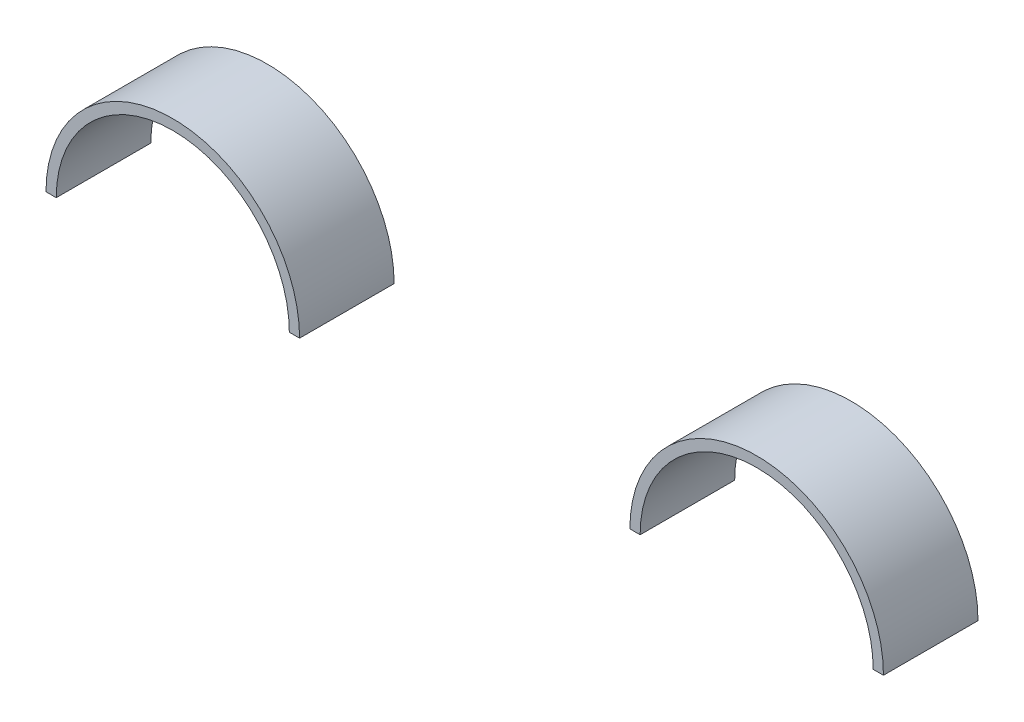
ISO-10303-21;
HEADER;
FILE_DESCRIPTION(('STEP AP214'),'2;1');
FILE_NAME('part.step','',(''),(''),'','','');
FILE_SCHEMA(('AUTOMOTIVE_DESIGN { 1 0 10303 214 1 1 1 1 }'));
ENDSEC;
DATA;
#1=APPLICATION_CONTEXT('core data for automotive mechanical design processes');
#2=APPLICATION_PROTOCOL_DEFINITION('international standard','automotive_design',2000,#1);
#3=PRODUCT_CONTEXT('',#1,'mechanical');
#4=PRODUCT('Part','Part','',(#3));
#5=PRODUCT_RELATED_PRODUCT_CATEGORY('part','',(#4));
#6=PRODUCT_DEFINITION_FORMATION('','',#4);
#7=PRODUCT_DEFINITION_CONTEXT('part definition',#1,'design');
#8=PRODUCT_DEFINITION('design','',#6,#7);
#9=PRODUCT_DEFINITION_SHAPE('','',#8);
#10=(LENGTH_UNIT() NAMED_UNIT(*) SI_UNIT(.MILLI.,.METRE.));
#11=(NAMED_UNIT(*) PLANE_ANGLE_UNIT() SI_UNIT($,.RADIAN.));
#12=(NAMED_UNIT(*) SI_UNIT($,.STERADIAN.) SOLID_ANGLE_UNIT());
#13=UNCERTAINTY_MEASURE_WITH_UNIT(LENGTH_MEASURE(1.E-05),#10,'distance_accuracy_value','');
#14=(GEOMETRIC_REPRESENTATION_CONTEXT(3) GLOBAL_UNCERTAINTY_ASSIGNED_CONTEXT((#13)) GLOBAL_UNIT_ASSIGNED_CONTEXT((#10,
#11,#12)) REPRESENTATION_CONTEXT('',''));
#15=CARTESIAN_POINT('',(0.,0.,0.));
#16=DIRECTION('',(0.,0.,1.));
#17=DIRECTION('',(1.,0.,0.));
#18=AXIS2_PLACEMENT_3D('',#15,#16,#17);
#19=CARTESIAN_POINT('',(1699.7804727587,-326.790615215042,522.682336201567));
#20=DIRECTION('',(0.,0.,1.));
#21=DIRECTION('',(1.,0.,0.));
#22=AXIS2_PLACEMENT_3D('',#19,#20,#21);
#23=CYLINDRICAL_SURFACE('',#22,50.);
#24=CARTESIAN_POINT('',(1699.7804727587,-326.790615215042,563.242336201567));
#25=DIRECTION('',(0.,0.,1.));
#26=DIRECTION('',(1.,0.,0.));
#27=AXIS2_PLACEMENT_3D('',#24,#25,#26);
#28=CIRCLE('',#27,50.);
#29=CARTESIAN_POINT('',(1749.7804727587,-326.790615215042,563.242336201567));
#30=VERTEX_POINT('',#29);
#31=CARTESIAN_POINT('',(1649.7804727587,-326.790615215042,563.242336201567));
#32=VERTEX_POINT('',#31);
#33=EDGE_CURVE('E12',#30,#32,#28,.T.);
#34=ORIENTED_EDGE('',*,*,#33,.T.);
#35=DIRECTION('',(0.,0.,1.));
#36=VECTOR('',#35,1.);
#37=CARTESIAN_POINT('',(1649.7804727587,-326.790615215042,522.682336201567));
#38=LINE('',#37,#36);
#39=CARTESIAN_POINT('',(1649.7804727587,-326.790615215042,522.682336201567));
#40=VERTEX_POINT('',#39);
#41=EDGE_CURVE('E122',#40,#32,#38,.T.);
#42=ORIENTED_EDGE('',*,*,#41,.F.);
#43=CARTESIAN_POINT('',(1699.7804727587,-326.790615215042,522.682336201567));
#44=DIRECTION('',(0.,0.,1.));
#45=DIRECTION('',(1.,0.,0.));
#46=AXIS2_PLACEMENT_3D('',#43,#44,#45);
#47=CIRCLE('',#46,50.);
#48=CARTESIAN_POINT('',(1749.7804727587,-326.790615215042,522.682336201567));
#49=VERTEX_POINT('',#48);
#50=EDGE_CURVE('E55',#49,#40,#47,.T.);
#51=ORIENTED_EDGE('',*,*,#50,.F.);
#52=DIRECTION('',(0.,0.,1.));
#53=VECTOR('',#52,1.);
#54=CARTESIAN_POINT('',(1749.7804727587,-326.790615215042,522.682336201567));
#55=LINE('',#54,#53);
#56=EDGE_CURVE('E110',#49,#30,#55,.T.);
#57=ORIENTED_EDGE('',*,*,#56,.T.);
#58=EDGE_LOOP('',(#34,#42,#51,#57));
#59=FACE_BOUND('',#58,.T.);
#60=ADVANCED_FACE('F51',(#59),#23,.F.);
#61=CARTESIAN_POINT('',(1645.3804727587,-326.790615215042,522.682336201567));
#62=DIRECTION('',(0.,1.,0.));
#63=DIRECTION('',(0.,0.,1.));
#64=AXIS2_PLACEMENT_3D('',#61,#62,#63);
#65=PLANE('',#64);
#66=DIRECTION('',(-1.,0.,0.));
#67=VECTOR('',#66,1.);
#68=CARTESIAN_POINT('',(1645.3804727587,-326.790615215042,563.242336201567));
#69=LINE('',#68,#67);
#70=CARTESIAN_POINT('',(1645.3804727587,-326.790615215042,563.242336201567));
#71=VERTEX_POINT('',#70);
#72=EDGE_CURVE('E61',#32,#71,#69,.T.);
#73=ORIENTED_EDGE('',*,*,#72,.T.);
#74=DIRECTION('',(0.,0.,1.));
#75=VECTOR('',#74,1.);
#76=CARTESIAN_POINT('',(1645.3804727587,-326.790615215042,522.682336201567));
#77=LINE('',#76,#75);
#78=CARTESIAN_POINT('',(1645.3804727587,-326.790615215042,522.682336201567));
#79=VERTEX_POINT('',#78);
#80=EDGE_CURVE('E106',#79,#71,#77,.T.);
#81=ORIENTED_EDGE('',*,*,#80,.F.);
#82=DIRECTION('',(-1.,0.,0.));
#83=VECTOR('',#82,1.);
#84=CARTESIAN_POINT('',(1645.3804727587,-326.790615215042,522.682336201567));
#85=LINE('',#84,#83);
#86=EDGE_CURVE('E85',#40,#79,#85,.T.);
#87=ORIENTED_EDGE('',*,*,#86,.F.);
#88=ORIENTED_EDGE('',*,*,#41,.T.);
#89=EDGE_LOOP('',(#73,#81,#87,#88));
#90=FACE_BOUND('',#89,.T.);
#91=ADVANCED_FACE('F125',(#90),#65,.F.);
#92=CARTESIAN_POINT('',(1699.7804727587,-326.790615215042,522.682336201567));
#93=DIRECTION('',(0.,0.,1.));
#94=DIRECTION('',(1.,0.,0.));
#95=AXIS2_PLACEMENT_3D('',#92,#93,#94);
#96=CYLINDRICAL_SURFACE('',#95,54.4);
#97=CARTESIAN_POINT('',(1699.7804727587,-326.790615215042,563.242336201567));
#98=DIRECTION('',(0.,0.,-1.));
#99=DIRECTION('',(1.,0.,0.));
#100=AXIS2_PLACEMENT_3D('',#97,#98,#99);
#101=CIRCLE('',#100,54.4);
#102=CARTESIAN_POINT('',(1754.1804727587,-326.790615215042,563.242336201567));
#103=VERTEX_POINT('',#102);
#104=EDGE_CURVE('E101',#71,#103,#101,.T.);
#105=ORIENTED_EDGE('',*,*,#104,.T.);
#106=DIRECTION('',(0.,0.,1.));
#107=VECTOR('',#106,1.);
#108=CARTESIAN_POINT('',(1754.1804727587,-326.790615215042,522.682336201567));
#109=LINE('',#108,#107);
#110=CARTESIAN_POINT('',(1754.1804727587,-326.790615215042,522.682336201567));
#111=VERTEX_POINT('',#110);
#112=EDGE_CURVE('E104',#111,#103,#109,.T.);
#113=ORIENTED_EDGE('',*,*,#112,.F.);
#114=CARTESIAN_POINT('',(1699.7804727587,-326.790615215042,522.682336201567));
#115=DIRECTION('',(0.,0.,-1.));
#116=DIRECTION('',(1.,0.,0.));
#117=AXIS2_PLACEMENT_3D('',#114,#115,#116);
#118=CIRCLE('',#117,54.4);
#119=EDGE_CURVE('E118',#79,#111,#118,.T.);
#120=ORIENTED_EDGE('',*,*,#119,.F.);
#121=ORIENTED_EDGE('',*,*,#80,.T.);
#122=EDGE_LOOP('',(#105,#113,#120,#121));
#123=FACE_BOUND('',#122,.T.);
#124=ADVANCED_FACE('F102',(#123),#96,.T.);
#125=CARTESIAN_POINT('',(1749.7804727587,-326.790615215042,522.682336201567));
#126=DIRECTION('',(0.,1.,0.));
#127=DIRECTION('',(0.,0.,1.));
#128=AXIS2_PLACEMENT_3D('',#125,#126,#127);
#129=PLANE('',#128);
#130=DIRECTION('',(-1.,0.,0.));
#131=VECTOR('',#130,1.);
#132=CARTESIAN_POINT('',(1749.7804727587,-326.790615215042,563.242336201567));
#133=LINE('',#132,#131);
#134=EDGE_CURVE('E95',#103,#30,#133,.T.);
#135=ORIENTED_EDGE('',*,*,#134,.T.);
#136=ORIENTED_EDGE('',*,*,#56,.F.);
#137=DIRECTION('',(-1.,0.,0.));
#138=VECTOR('',#137,1.);
#139=CARTESIAN_POINT('',(1749.7804727587,-326.790615215042,522.682336201567));
#140=LINE('',#139,#138);
#141=EDGE_CURVE('E109',#111,#49,#140,.T.);
#142=ORIENTED_EDGE('',*,*,#141,.F.);
#143=ORIENTED_EDGE('',*,*,#112,.T.);
#144=EDGE_LOOP('',(#135,#136,#142,#143));
#145=FACE_BOUND('',#144,.T.);
#146=ADVANCED_FACE('F108',(#145),#129,.F.);
#147=CARTESIAN_POINT('',(1699.7804727587,-326.790615215042,522.682336201567));
#148=DIRECTION('',(0.,0.,1.));
#149=DIRECTION('',(1.,0.,0.));
#150=AXIS2_PLACEMENT_3D('',#147,#148,#149);
#151=PLANE('',#150);
#152=ORIENTED_EDGE('',*,*,#50,.T.);
#153=ORIENTED_EDGE('',*,*,#86,.T.);
#154=ORIENTED_EDGE('',*,*,#119,.T.);
#155=ORIENTED_EDGE('',*,*,#141,.T.);
#156=EDGE_LOOP('',(#152,#153,#154,#155));
#157=FACE_BOUND('',#156,.T.);
#158=ADVANCED_FACE('F53',(#157),#151,.F.);
#159=CARTESIAN_POINT('',(1699.7804727587,-326.790615215042,563.242336201567));
#160=DIRECTION('',(0.,0.,1.));
#161=DIRECTION('',(1.,0.,0.));
#162=AXIS2_PLACEMENT_3D('',#159,#160,#161);
#163=PLANE('',#162);
#164=ORIENTED_EDGE('',*,*,#33,.F.);
#165=ORIENTED_EDGE('',*,*,#134,.F.);
#166=ORIENTED_EDGE('',*,*,#104,.F.);
#167=ORIENTED_EDGE('',*,*,#72,.F.);
#168=EDGE_LOOP('',(#164,#165,#166,#167));
#169=FACE_BOUND('',#168,.T.);
#170=ADVANCED_FACE('F112',(#169),#163,.T.);
#171=CLOSED_SHELL('',(#60,#91,#124,#146,#158,#170));
#172=MANIFOLD_SOLID_BREP('B2',#171);
#173=CARTESIAN_POINT('',(1449.2804727587,-326.790615215035,522.682336201567));
#174=DIRECTION('',(0.,0.,1.));
#175=DIRECTION('',(1.,0.,0.));
#176=AXIS2_PLACEMENT_3D('',#173,#174,#175);
#177=CYLINDRICAL_SURFACE('',#176,50.);
#178=CARTESIAN_POINT('',(1449.2804727587,-326.790615215035,563.242336201567));
#179=DIRECTION('',(0.,0.,1.));
#180=DIRECTION('',(1.,0.,0.));
#181=AXIS2_PLACEMENT_3D('',#178,#179,#180);
#182=CIRCLE('',#181,50.);
#183=CARTESIAN_POINT('',(1499.2804727587,-326.790615215034,563.242336201567));
#184=VERTEX_POINT('',#183);
#185=CARTESIAN_POINT('',(1399.2804727587,-326.790615215034,563.242336201567));
#186=VERTEX_POINT('',#185);
#187=EDGE_CURVE('E238',#184,#186,#182,.T.);
#188=ORIENTED_EDGE('',*,*,#187,.T.);
#189=DIRECTION('',(0.,0.,1.));
#190=VECTOR('',#189,1.);
#191=CARTESIAN_POINT('',(1399.2804727587,-326.790615215034,522.682336201567));
#192=LINE('',#191,#190);
#193=CARTESIAN_POINT('',(1399.2804727587,-326.790615215034,522.682336201567));
#194=VERTEX_POINT('',#193);
#195=EDGE_CURVE('E49',#194,#186,#192,.T.);
#196=ORIENTED_EDGE('',*,*,#195,.F.);
#197=CARTESIAN_POINT('',(1449.2804727587,-326.790615215035,522.682336201567));
#198=DIRECTION('',(0.,0.,1.));
#199=DIRECTION('',(1.,0.,0.));
#200=AXIS2_PLACEMENT_3D('',#197,#198,#199);
#201=CIRCLE('',#200,50.);
#202=CARTESIAN_POINT('',(1499.2804727587,-326.790615215034,522.682336201567));
#203=VERTEX_POINT('',#202);
#204=EDGE_CURVE('E226',#203,#194,#201,.T.);
#205=ORIENTED_EDGE('',*,*,#204,.F.);
#206=DIRECTION('',(0.,0.,1.));
#207=VECTOR('',#206,1.);
#208=CARTESIAN_POINT('',(1499.2804727587,-326.790615215034,522.682336201567));
#209=LINE('',#208,#207);
#210=EDGE_CURVE('E234',#203,#184,#209,.T.);
#211=ORIENTED_EDGE('',*,*,#210,.T.);
#212=EDGE_LOOP('',(#188,#196,#205,#211));
#213=FACE_BOUND('',#212,.T.);
#214=ADVANCED_FACE('F175',(#213),#177,.F.);
#215=CARTESIAN_POINT('',(1394.8804727587,-326.790615215033,522.682336201567));
#216=DIRECTION('',(0.,1.,0.));
#217=DIRECTION('',(-1.,0.,0.));
#218=AXIS2_PLACEMENT_3D('',#215,#216,#217);
#219=PLANE('',#218);
#220=DIRECTION('',(-1.,0.,0.));
#221=VECTOR('',#220,1.);
#222=CARTESIAN_POINT('',(1394.8804727587,-326.790615215033,563.242336201567));
#223=LINE('',#222,#221);
#224=CARTESIAN_POINT('',(1394.8804727587,-326.790615215033,563.242336201567));
#225=VERTEX_POINT('',#224);
#226=EDGE_CURVE('E230',#186,#225,#223,.T.);
#227=ORIENTED_EDGE('',*,*,#226,.T.);
#228=DIRECTION('',(0.,0.,1.));
#229=VECTOR('',#228,1.);
#230=CARTESIAN_POINT('',(1394.8804727587,-326.790615215033,522.682336201567));
#231=LINE('',#230,#229);
#232=CARTESIAN_POINT('',(1394.8804727587,-326.790615215033,522.682336201567));
#233=VERTEX_POINT('',#232);
#234=EDGE_CURVE('E183',#233,#225,#231,.T.);
#235=ORIENTED_EDGE('',*,*,#234,.F.);
#236=DIRECTION('',(-1.,0.,0.));
#237=VECTOR('',#236,1.);
#238=CARTESIAN_POINT('',(1394.8804727587,-326.790615215033,522.682336201567));
#239=LINE('',#238,#237);
#240=EDGE_CURVE('E221',#194,#233,#239,.T.);
#241=ORIENTED_EDGE('',*,*,#240,.F.);
#242=ORIENTED_EDGE('',*,*,#195,.T.);
#243=EDGE_LOOP('',(#227,#235,#241,#242));
#244=FACE_BOUND('',#243,.T.);
#245=ADVANCED_FACE('F229',(#244),#219,.F.);
#246=CARTESIAN_POINT('',(1449.2804727587,-326.790615215035,522.682336201567));
#247=DIRECTION('',(0.,0.,1.));
#248=DIRECTION('',(1.,0.,0.));
#249=AXIS2_PLACEMENT_3D('',#246,#247,#248);
#250=CYLINDRICAL_SURFACE('',#249,54.4);
#251=CARTESIAN_POINT('',(1449.2804727587,-326.790615215035,563.242336201567));
#252=DIRECTION('',(0.,0.,-1.));
#253=DIRECTION('',(1.,0.,0.));
#254=AXIS2_PLACEMENT_3D('',#251,#252,#253);
#255=CIRCLE('',#254,54.4);
#256=CARTESIAN_POINT('',(1503.6804727587,-326.790615215033,563.242336201567));
#257=VERTEX_POINT('',#256);
#258=EDGE_CURVE('E208',#225,#257,#255,.T.);
#259=ORIENTED_EDGE('',*,*,#258,.T.);
#260=DIRECTION('',(0.,0.,1.));
#261=VECTOR('',#260,1.);
#262=CARTESIAN_POINT('',(1503.6804727587,-326.790615215033,522.682336201567));
#263=LINE('',#262,#261);
#264=CARTESIAN_POINT('',(1503.6804727587,-326.790615215033,522.682336201567));
#265=VERTEX_POINT('',#264);
#266=EDGE_CURVE('E231',#265,#257,#263,.T.);
#267=ORIENTED_EDGE('',*,*,#266,.F.);
#268=CARTESIAN_POINT('',(1449.2804727587,-326.790615215035,522.682336201567));
#269=DIRECTION('',(0.,0.,-1.));
#270=DIRECTION('',(1.,0.,0.));
#271=AXIS2_PLACEMENT_3D('',#268,#269,#270);
#272=CIRCLE('',#271,54.4);
#273=EDGE_CURVE('E224',#233,#265,#272,.T.);
#274=ORIENTED_EDGE('',*,*,#273,.F.);
#275=ORIENTED_EDGE('',*,*,#234,.T.);
#276=EDGE_LOOP('',(#259,#267,#274,#275));
#277=FACE_BOUND('',#276,.T.);
#278=ADVANCED_FACE('F232',(#277),#250,.T.);
#279=CARTESIAN_POINT('',(1503.6804727587,-326.790615215033,522.682336201567));
#280=DIRECTION('',(0.,1.,0.));
#281=DIRECTION('',(-1.,0.,0.));
#282=AXIS2_PLACEMENT_3D('',#279,#280,#281);
#283=PLANE('',#282);
#284=DIRECTION('',(-1.,0.,0.));
#285=VECTOR('',#284,1.);
#286=CARTESIAN_POINT('',(1503.6804727587,-326.790615215033,563.242336201567));
#287=LINE('',#286,#285);
#288=EDGE_CURVE('E214',#257,#184,#287,.T.);
#289=ORIENTED_EDGE('',*,*,#288,.T.);
#290=ORIENTED_EDGE('',*,*,#210,.F.);
#291=DIRECTION('',(-1.,0.,0.));
#292=VECTOR('',#291,1.);
#293=CARTESIAN_POINT('',(1503.6804727587,-326.790615215033,522.682336201567));
#294=LINE('',#293,#292);
#295=EDGE_CURVE('E191',#265,#203,#294,.T.);
#296=ORIENTED_EDGE('',*,*,#295,.F.);
#297=ORIENTED_EDGE('',*,*,#266,.T.);
#298=EDGE_LOOP('',(#289,#290,#296,#297));
#299=FACE_BOUND('',#298,.T.);
#300=ADVANCED_FACE('F245',(#299),#283,.F.);
#301=CARTESIAN_POINT('',(1449.2804727587,-326.790615215035,522.682336201567));
#302=DIRECTION('',(0.,0.,1.));
#303=DIRECTION('',(1.,0.,0.));
#304=AXIS2_PLACEMENT_3D('',#301,#302,#303);
#305=PLANE('',#304);
#306=ORIENTED_EDGE('',*,*,#204,.T.);
#307=ORIENTED_EDGE('',*,*,#240,.T.);
#308=ORIENTED_EDGE('',*,*,#273,.T.);
#309=ORIENTED_EDGE('',*,*,#295,.T.);
#310=EDGE_LOOP('',(#306,#307,#308,#309));
#311=FACE_BOUND('',#310,.T.);
#312=ADVANCED_FACE('F222',(#311),#305,.F.);
#313=CARTESIAN_POINT('',(1449.2804727587,-326.790615215035,563.242336201567));
#314=DIRECTION('',(0.,0.,1.));
#315=DIRECTION('',(1.,0.,0.));
#316=AXIS2_PLACEMENT_3D('',#313,#314,#315);
#317=PLANE('',#316);
#318=ORIENTED_EDGE('',*,*,#187,.F.);
#319=ORIENTED_EDGE('',*,*,#288,.F.);
#320=ORIENTED_EDGE('',*,*,#258,.F.);
#321=ORIENTED_EDGE('',*,*,#226,.F.);
#322=EDGE_LOOP('',(#318,#319,#320,#321));
#323=FACE_BOUND('',#322,.T.);
#324=ADVANCED_FACE('F248',(#323),#317,.T.);
#325=CLOSED_SHELL('',(#214,#245,#278,#300,#312,#324));
#326=MANIFOLD_SOLID_BREP('B6',#325);
#327=ADVANCED_BREP_SHAPE_REPRESENTATION('',(#18,#172,#326),#14);
#328=SHAPE_DEFINITION_REPRESENTATION(#9,#327);
ENDSEC;
END-ISO-10303-21;
